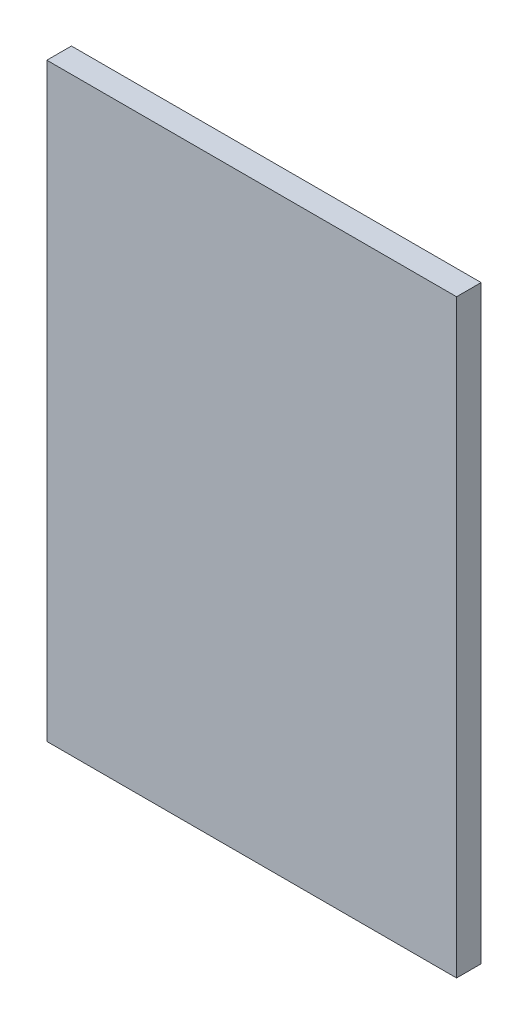
ISO-10303-21;
HEADER;
FILE_DESCRIPTION(('STEP AP214'),'2;1');
FILE_NAME('part.step','',(''),(''),'','','');
FILE_SCHEMA(('AUTOMOTIVE_DESIGN { 1 0 10303 214 1 1 1 1 }'));
ENDSEC;
DATA;
#1=APPLICATION_CONTEXT('core data for automotive mechanical design processes');
#2=APPLICATION_PROTOCOL_DEFINITION('international standard','automotive_design',2000,#1);
#3=PRODUCT_CONTEXT('',#1,'mechanical');
#4=PRODUCT('Part','Part','',(#3));
#5=PRODUCT_RELATED_PRODUCT_CATEGORY('part','',(#4));
#6=PRODUCT_DEFINITION_FORMATION('','',#4);
#7=PRODUCT_DEFINITION_CONTEXT('part definition',#1,'design');
#8=PRODUCT_DEFINITION('design','',#6,#7);
#9=PRODUCT_DEFINITION_SHAPE('','',#8);
#10=(LENGTH_UNIT() NAMED_UNIT(*) SI_UNIT(.MILLI.,.METRE.));
#11=(NAMED_UNIT(*) PLANE_ANGLE_UNIT() SI_UNIT($,.RADIAN.));
#12=(NAMED_UNIT(*) SI_UNIT($,.STERADIAN.) SOLID_ANGLE_UNIT());
#13=UNCERTAINTY_MEASURE_WITH_UNIT(LENGTH_MEASURE(1.E-05),#10,'distance_accuracy_value','');
#14=(GEOMETRIC_REPRESENTATION_CONTEXT(3) GLOBAL_UNCERTAINTY_ASSIGNED_CONTEXT((#13)) GLOBAL_UNIT_ASSIGNED_CONTEXT((#10,
#11,#12)) REPRESENTATION_CONTEXT('',''));
#15=CARTESIAN_POINT('',(0.,0.,0.));
#16=DIRECTION('',(0.,0.,1.));
#17=DIRECTION('',(1.,0.,0.));
#18=AXIS2_PLACEMENT_3D('',#15,#16,#17);
#19=CARTESIAN_POINT('',(-6.35162601626016,7.52032520325202,3.));
#20=DIRECTION('',(1.,0.,0.));
#21=DIRECTION('',(0.,1.,0.));
#22=AXIS2_PLACEMENT_3D('',#19,#20,#21);
#23=PLANE('',#22);
#24=DIRECTION('',(0.,-1.,0.));
#25=VECTOR('',#24,1.);
#26=CARTESIAN_POINT('',(-6.35162601626016,7.52032520325202,0.));
#27=LINE('',#26,#25);
#28=CARTESIAN_POINT('',(-6.35162601626016,7.52032520325202,0.));
#29=VERTEX_POINT('',#28);
#30=CARTESIAN_POINT('',(-6.35162601626015,-64.479674796748,0.));
#31=VERTEX_POINT('',#30);
#32=EDGE_CURVE('E109',#29,#31,#27,.T.);
#33=ORIENTED_EDGE('',*,*,#32,.T.);
#34=DIRECTION('',(0.,0.,-1.));
#35=VECTOR('',#34,1.);
#36=CARTESIAN_POINT('',(-6.35162601626015,-64.479674796748,3.));
#37=LINE('',#36,#35);
#38=CARTESIAN_POINT('',(-6.35162601626015,-64.479674796748,3.));
#39=VERTEX_POINT('',#38);
#40=EDGE_CURVE('E11',#39,#31,#37,.T.);
#41=ORIENTED_EDGE('',*,*,#40,.F.);
#42=DIRECTION('',(0.,-1.,0.));
#43=VECTOR('',#42,1.);
#44=CARTESIAN_POINT('',(-6.35162601626016,7.52032520325202,3.));
#45=LINE('',#44,#43);
#46=CARTESIAN_POINT('',(-6.35162601626016,7.52032520325202,3.));
#47=VERTEX_POINT('',#46);
#48=EDGE_CURVE('E91',#47,#39,#45,.T.);
#49=ORIENTED_EDGE('',*,*,#48,.F.);
#50=DIRECTION('',(0.,0.,-1.));
#51=VECTOR('',#50,1.);
#52=CARTESIAN_POINT('',(-6.35162601626016,7.52032520325202,3.));
#53=LINE('',#52,#51);
#54=EDGE_CURVE('E105',#47,#29,#53,.T.);
#55=ORIENTED_EDGE('',*,*,#54,.T.);
#56=EDGE_LOOP('',(#33,#41,#49,#55));
#57=FACE_BOUND('',#56,.T.);
#58=ADVANCED_FACE('F39',(#57),#23,.F.);
#59=CARTESIAN_POINT('',(-6.35162601626015,-64.479674796748,3.));
#60=DIRECTION('',(0.,1.,0.));
#61=DIRECTION('',(0.,0.,1.));
#62=AXIS2_PLACEMENT_3D('',#59,#60,#61);
#63=PLANE('',#62);
#64=DIRECTION('',(1.,0.,0.));
#65=VECTOR('',#64,1.);
#66=CARTESIAN_POINT('',(-6.35162601626015,-64.479674796748,0.));
#67=LINE('',#66,#65);
#68=CARTESIAN_POINT('',(43.6483739837399,-64.479674796748,0.));
#69=VERTEX_POINT('',#68);
#70=EDGE_CURVE('E96',#31,#69,#67,.T.);
#71=ORIENTED_EDGE('',*,*,#70,.T.);
#72=DIRECTION('',(0.,0.,-1.));
#73=VECTOR('',#72,1.);
#74=CARTESIAN_POINT('',(43.6483739837399,-64.479674796748,3.));
#75=LINE('',#74,#73);
#76=CARTESIAN_POINT('',(43.6483739837399,-64.479674796748,3.));
#77=VERTEX_POINT('',#76);
#78=EDGE_CURVE('E48',#77,#69,#75,.T.);
#79=ORIENTED_EDGE('',*,*,#78,.F.);
#80=DIRECTION('',(1.,0.,0.));
#81=VECTOR('',#80,1.);
#82=CARTESIAN_POINT('',(-6.35162601626015,-64.479674796748,3.));
#83=LINE('',#82,#81);
#84=EDGE_CURVE('E86',#39,#77,#83,.T.);
#85=ORIENTED_EDGE('',*,*,#84,.F.);
#86=ORIENTED_EDGE('',*,*,#40,.T.);
#87=EDGE_LOOP('',(#71,#79,#85,#86));
#88=FACE_BOUND('',#87,.T.);
#89=ADVANCED_FACE('F95',(#88),#63,.F.);
#90=CARTESIAN_POINT('',(43.6483739837398,7.52032520325202,3.));
#91=DIRECTION('',(-1.,0.,0.));
#92=DIRECTION('',(0.,-1.,0.));
#93=AXIS2_PLACEMENT_3D('',#90,#91,#92);
#94=PLANE('',#93);
#95=DIRECTION('',(0.,1.,0.));
#96=VECTOR('',#95,1.);
#97=CARTESIAN_POINT('',(43.6483739837398,7.52032520325202,0.));
#98=LINE('',#97,#96);
#99=CARTESIAN_POINT('',(43.6483739837398,7.52032520325202,0.));
#100=VERTEX_POINT('',#99);
#101=EDGE_CURVE('E73',#69,#100,#98,.T.);
#102=ORIENTED_EDGE('',*,*,#101,.T.);
#103=DIRECTION('',(0.,0.,-1.));
#104=VECTOR('',#103,1.);
#105=CARTESIAN_POINT('',(43.6483739837398,7.52032520325202,3.));
#106=LINE('',#105,#104);
#107=CARTESIAN_POINT('',(43.6483739837398,7.52032520325202,3.));
#108=VERTEX_POINT('',#107);
#109=EDGE_CURVE('E98',#108,#100,#106,.T.);
#110=ORIENTED_EDGE('',*,*,#109,.F.);
#111=DIRECTION('',(0.,1.,0.));
#112=VECTOR('',#111,1.);
#113=CARTESIAN_POINT('',(43.6483739837398,7.52032520325202,3.));
#114=LINE('',#113,#112);
#115=EDGE_CURVE('E89',#77,#108,#114,.T.);
#116=ORIENTED_EDGE('',*,*,#115,.F.);
#117=ORIENTED_EDGE('',*,*,#78,.T.);
#118=EDGE_LOOP('',(#102,#110,#116,#117));
#119=FACE_BOUND('',#118,.T.);
#120=ADVANCED_FACE('F99',(#119),#94,.F.);
#121=CARTESIAN_POINT('',(-6.35162601626016,7.52032520325202,3.));
#122=DIRECTION('',(0.,-1.,0.));
#123=DIRECTION('',(0.,0.,-1.));
#124=AXIS2_PLACEMENT_3D('',#121,#122,#123);
#125=PLANE('',#124);
#126=DIRECTION('',(-1.,0.,0.));
#127=VECTOR('',#126,1.);
#128=CARTESIAN_POINT('',(-6.35162601626016,7.52032520325202,0.));
#129=LINE('',#128,#127);
#130=EDGE_CURVE('E79',#100,#29,#129,.T.);
#131=ORIENTED_EDGE('',*,*,#130,.T.);
#132=ORIENTED_EDGE('',*,*,#54,.F.);
#133=DIRECTION('',(-1.,0.,0.));
#134=VECTOR('',#133,1.);
#135=CARTESIAN_POINT('',(-6.35162601626016,7.52032520325202,3.));
#136=LINE('',#135,#134);
#137=EDGE_CURVE('E56',#108,#47,#136,.T.);
#138=ORIENTED_EDGE('',*,*,#137,.F.);
#139=ORIENTED_EDGE('',*,*,#109,.T.);
#140=EDGE_LOOP('',(#131,#132,#138,#139));
#141=FACE_BOUND('',#140,.T.);
#142=ADVANCED_FACE('F120',(#141),#125,.F.);
#143=CARTESIAN_POINT('',(0.,0.,3.));
#144=DIRECTION('',(0.,0.,1.));
#145=DIRECTION('',(1.,0.,0.));
#146=AXIS2_PLACEMENT_3D('',#143,#144,#145);
#147=PLANE('',#146);
#148=ORIENTED_EDGE('',*,*,#48,.T.);
#149=ORIENTED_EDGE('',*,*,#84,.T.);
#150=ORIENTED_EDGE('',*,*,#115,.T.);
#151=ORIENTED_EDGE('',*,*,#137,.T.);
#152=EDGE_LOOP('',(#148,#149,#150,#151));
#153=FACE_BOUND('',#152,.T.);
#154=ADVANCED_FACE('F87',(#153),#147,.T.);
#155=CARTESIAN_POINT('',(0.,0.,0.));
#156=DIRECTION('',(0.,0.,1.));
#157=DIRECTION('',(1.,0.,0.));
#158=AXIS2_PLACEMENT_3D('',#155,#156,#157);
#159=PLANE('',#158);
#160=ORIENTED_EDGE('',*,*,#32,.F.);
#161=ORIENTED_EDGE('',*,*,#130,.F.);
#162=ORIENTED_EDGE('',*,*,#101,.F.);
#163=ORIENTED_EDGE('',*,*,#70,.F.);
#164=EDGE_LOOP('',(#160,#161,#162,#163));
#165=FACE_BOUND('',#164,.T.);
#166=ADVANCED_FACE('F123',(#165),#159,.F.);
#167=CLOSED_SHELL('',(#58,#89,#120,#142,#154,#166));
#168=MANIFOLD_SOLID_BREP('B2',#167);
#169=ADVANCED_BREP_SHAPE_REPRESENTATION('',(#18,#168),#14);
#170=SHAPE_DEFINITION_REPRESENTATION(#9,#169);
ENDSEC;
END-ISO-10303-21;
